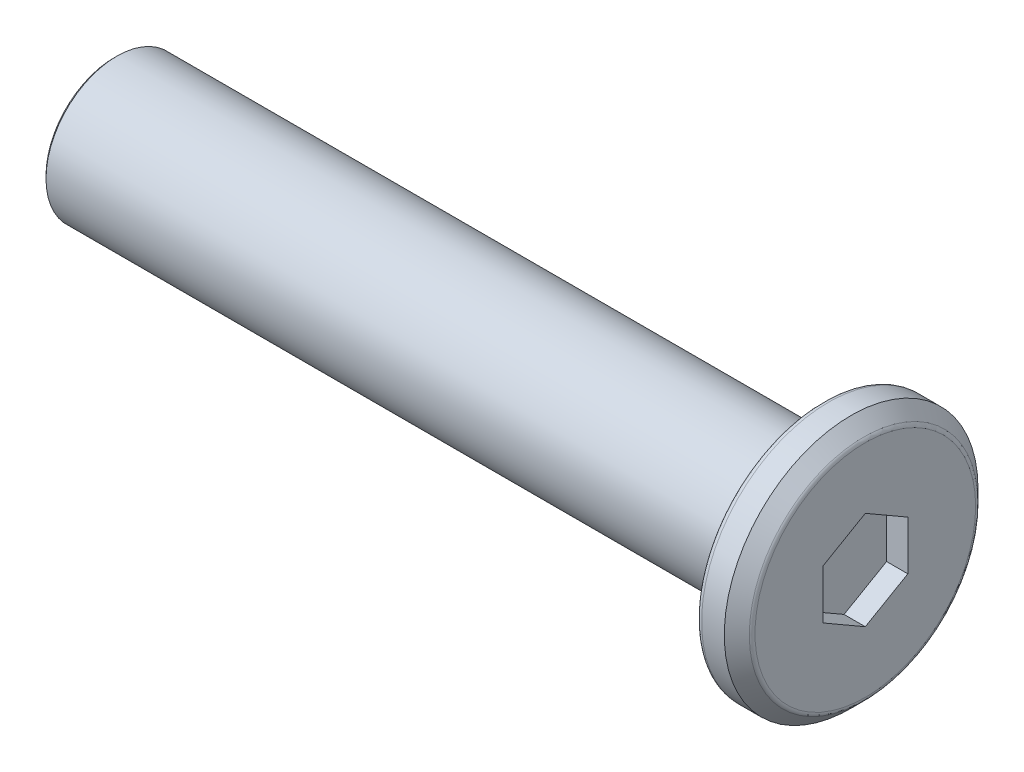
ISO-10303-21;
HEADER;
FILE_DESCRIPTION(('STEP AP214'),'2;1');
FILE_NAME('part.step','',(''),(''),'','','');
FILE_SCHEMA(('AUTOMOTIVE_DESIGN { 1 0 10303 214 1 1 1 1 }'));
ENDSEC;
DATA;
#1=APPLICATION_CONTEXT('core data for automotive mechanical design processes');
#2=APPLICATION_PROTOCOL_DEFINITION('international standard','automotive_design',2000,#1);
#3=PRODUCT_CONTEXT('',#1,'mechanical');
#4=PRODUCT('Part','Part','',(#3));
#5=PRODUCT_RELATED_PRODUCT_CATEGORY('part','',(#4));
#6=PRODUCT_DEFINITION_FORMATION('','',#4);
#7=PRODUCT_DEFINITION_CONTEXT('part definition',#1,'design');
#8=PRODUCT_DEFINITION('design','',#6,#7);
#9=PRODUCT_DEFINITION_SHAPE('','',#8);
#10=(LENGTH_UNIT() NAMED_UNIT(*) SI_UNIT(.MILLI.,.METRE.));
#11=(NAMED_UNIT(*) PLANE_ANGLE_UNIT() SI_UNIT($,.RADIAN.));
#12=(NAMED_UNIT(*) SI_UNIT($,.STERADIAN.) SOLID_ANGLE_UNIT());
#13=UNCERTAINTY_MEASURE_WITH_UNIT(LENGTH_MEASURE(1.E-05),#10,'distance_accuracy_value','');
#14=(GEOMETRIC_REPRESENTATION_CONTEXT(3) GLOBAL_UNCERTAINTY_ASSIGNED_CONTEXT((#13)) GLOBAL_UNIT_ASSIGNED_CONTEXT((#10,
#11,#12)) REPRESENTATION_CONTEXT('',''));
#15=CARTESIAN_POINT('',(0.,0.,0.));
#16=DIRECTION('',(0.,0.,1.));
#17=DIRECTION('',(1.,0.,0.));
#18=AXIS2_PLACEMENT_3D('',#15,#16,#17);
#19=CARTESIAN_POINT('',(0.75,0.,0.));
#20=DIRECTION('',(1.,0.,0.));
#21=DIRECTION('',(0.,0.,-1.));
#22=AXIS2_PLACEMENT_3D('',#19,#20,#21);
#23=PLANE('',#22);
#24=CARTESIAN_POINT('',(0.75,0.,0.));
#25=DIRECTION('',(1.,0.,0.));
#26=DIRECTION('',(0.,0.,-1.));
#27=AXIS2_PLACEMENT_3D('',#24,#25,#26);
#28=CIRCLE('',#27,3.89215728752539);
#29=CARTESIAN_POINT('',(0.75,0.,-3.89215728752539));
#30=VERTEX_POINT('',#29);
#31=EDGE_CURVE('E132',#30,#30,#28,.T.);
#32=ORIENTED_EDGE('',*,*,#31,.T.);
#33=EDGE_LOOP('',(#32));
#34=FACE_BOUND('',#33,.T.);
#35=DIRECTION('',(0.,-1.,0.));
#36=VECTOR('',#35,1.);
#37=CARTESIAN_POINT('',(0.75,0.,-1.5));
#38=LINE('',#37,#36);
#39=CARTESIAN_POINT('',(0.75,0.866025403784438,-1.5));
#40=VERTEX_POINT('',#39);
#41=CARTESIAN_POINT('',(0.75,-0.866025403784439,-1.5));
#42=VERTEX_POINT('',#41);
#43=EDGE_CURVE('E120',#40,#42,#38,.T.);
#44=ORIENTED_EDGE('',*,*,#43,.T.);
#45=DIRECTION('',(0.,-0.5,0.866025403784439));
#46=VECTOR('',#45,1.);
#47=CARTESIAN_POINT('',(0.75,-1.29903810567666,-0.75));
#48=LINE('',#47,#46);
#49=CARTESIAN_POINT('',(0.75,-1.73205080756888,0.));
#50=VERTEX_POINT('',#49);
#51=EDGE_CURVE('E40',#42,#50,#48,.T.);
#52=ORIENTED_EDGE('',*,*,#51,.T.);
#53=DIRECTION('',(0.,0.5,0.866025403784439));
#54=VECTOR('',#53,1.);
#55=CARTESIAN_POINT('',(0.75,-1.29903810567666,0.75));
#56=LINE('',#55,#54);
#57=CARTESIAN_POINT('',(0.75,-0.866025403784438,1.5));
#58=VERTEX_POINT('',#57);
#59=EDGE_CURVE('E76',#50,#58,#56,.T.);
#60=ORIENTED_EDGE('',*,*,#59,.T.);
#61=DIRECTION('',(0.,1.,0.));
#62=VECTOR('',#61,1.);
#63=CARTESIAN_POINT('',(0.75,0.,1.5));
#64=LINE('',#63,#62);
#65=CARTESIAN_POINT('',(0.75,0.866025403784439,1.5));
#66=VERTEX_POINT('',#65);
#67=EDGE_CURVE('E111',#58,#66,#64,.T.);
#68=ORIENTED_EDGE('',*,*,#67,.T.);
#69=DIRECTION('',(0.,0.5,-0.866025403784439));
#70=VECTOR('',#69,1.);
#71=CARTESIAN_POINT('',(0.75,1.29903810567666,0.75));
#72=LINE('',#71,#70);
#73=CARTESIAN_POINT('',(0.75,1.73205080756888,0.));
#74=VERTEX_POINT('',#73);
#75=EDGE_CURVE('E114',#66,#74,#72,.T.);
#76=ORIENTED_EDGE('',*,*,#75,.T.);
#77=DIRECTION('',(0.,-0.5,-0.866025403784439));
#78=VECTOR('',#77,1.);
#79=CARTESIAN_POINT('',(0.75,1.29903810567666,-0.75));
#80=LINE('',#79,#78);
#81=EDGE_CURVE('E117',#74,#40,#80,.T.);
#82=ORIENTED_EDGE('',*,*,#81,.T.);
#83=EDGE_LOOP('',(#44,#52,#60,#68,#76,#82));
#84=FACE_BOUND('',#83,.T.);
#85=ADVANCED_FACE('F16',(#34,#84),#23,.T.);
#86=CARTESIAN_POINT('',(-0.75,0.,0.));
#87=DIRECTION('',(1.,0.,0.));
#88=DIRECTION('',(0.,0.,-1.));
#89=AXIS2_PLACEMENT_3D('',#86,#87,#88);
#90=PLANE('',#89);
#91=CARTESIAN_POINT('',(-0.75,0.,0.));
#92=DIRECTION('',(1.,0.,0.));
#93=DIRECTION('',(0.,0.,-1.));
#94=AXIS2_PLACEMENT_3D('',#91,#92,#93);
#95=CIRCLE('',#94,4.275);
#96=CARTESIAN_POINT('',(-0.75,0.,-4.275));
#97=VERTEX_POINT('',#96);
#98=EDGE_CURVE('E141',#97,#97,#95,.F.);
#99=ORIENTED_EDGE('',*,*,#98,.T.);
#100=EDGE_LOOP('',(#99));
#101=FACE_BOUND('',#100,.T.);
#102=CARTESIAN_POINT('',(-0.75,0.,0.));
#103=DIRECTION('',(1.,0.,0.));
#104=DIRECTION('',(0.,0.,-1.));
#105=AXIS2_PLACEMENT_3D('',#102,#103,#104);
#106=CIRCLE('',#105,2.75);
#107=CARTESIAN_POINT('',(-0.75,0.,-2.75));
#108=VERTEX_POINT('',#107);
#109=EDGE_CURVE('E129',#108,#108,#106,.T.);
#110=ORIENTED_EDGE('',*,*,#109,.T.);
#111=EDGE_LOOP('',(#110));
#112=FACE_BOUND('',#111,.T.);
#113=ADVANCED_FACE('F159',(#101,#112),#90,.F.);
#114=CARTESIAN_POINT('',(0.75,0.,0.));
#115=DIRECTION('',(-1.,0.,0.));
#116=DIRECTION('',(0.,0.,1.));
#117=AXIS2_PLACEMENT_3D('',#114,#115,#116);
#118=CYLINDRICAL_SURFACE('',#117,4.475);
#119=CARTESIAN_POINT('',(-0.55,0.,0.));
#120=DIRECTION('',(1.,0.,0.));
#121=DIRECTION('',(0.,0.,-1.));
#122=AXIS2_PLACEMENT_3D('',#119,#120,#121);
#123=CIRCLE('',#122,4.475);
#124=CARTESIAN_POINT('',(-0.55,0.,-4.475));
#125=VERTEX_POINT('',#124);
#126=EDGE_CURVE('E138',#125,#125,#123,.T.);
#127=ORIENTED_EDGE('',*,*,#126,.T.);
#128=EDGE_LOOP('',(#127));
#129=FACE_BOUND('',#128,.T.);
#130=CARTESIAN_POINT('',(0.250000000000007,0.,0.));
#131=DIRECTION('',(1.,0.,0.));
#132=DIRECTION('',(0.,0.,-1.));
#133=AXIS2_PLACEMENT_3D('',#130,#131,#132);
#134=CIRCLE('',#133,4.475);
#135=CARTESIAN_POINT('',(0.250000000000007,0.,-4.475));
#136=VERTEX_POINT('',#135);
#137=EDGE_CURVE('E123',#136,#136,#134,.F.);
#138=ORIENTED_EDGE('',*,*,#137,.T.);
#139=EDGE_LOOP('',(#138));
#140=FACE_BOUND('',#139,.T.);
#141=ADVANCED_FACE('F165',(#129,#140),#118,.T.);
#142=CARTESIAN_POINT('',(-25.75,0.,0.));
#143=DIRECTION('',(1.,0.,0.));
#144=DIRECTION('',(0.,0.,-1.));
#145=AXIS2_PLACEMENT_3D('',#142,#143,#144);
#146=CYLINDRICAL_SURFACE('',#145,2.5);
#147=CARTESIAN_POINT('',(-25.65,0.,0.));
#148=DIRECTION('',(-1.,0.,0.));
#149=DIRECTION('',(0.,0.,1.));
#150=AXIS2_PLACEMENT_3D('',#147,#148,#149);
#151=CIRCLE('',#150,2.5);
#152=CARTESIAN_POINT('',(-25.65,0.,2.5));
#153=VERTEX_POINT('',#152);
#154=EDGE_CURVE('E10',#153,#153,#151,.F.);
#155=ORIENTED_EDGE('',*,*,#154,.T.);
#156=EDGE_LOOP('',(#155));
#157=FACE_BOUND('',#156,.T.);
#158=CARTESIAN_POINT('',(-1.,0.,0.));
#159=DIRECTION('',(1.,0.,0.));
#160=DIRECTION('',(0.,0.,-1.));
#161=AXIS2_PLACEMENT_3D('',#158,#159,#160);
#162=CIRCLE('',#161,2.5);
#163=CARTESIAN_POINT('',(-1.,0.,-2.5));
#164=VERTEX_POINT('',#163);
#165=EDGE_CURVE('E126',#164,#164,#162,.F.);
#166=ORIENTED_EDGE('',*,*,#165,.T.);
#167=EDGE_LOOP('',(#166));
#168=FACE_BOUND('',#167,.T.);
#169=ADVANCED_FACE('F170',(#157,#168),#146,.T.);
#170=CARTESIAN_POINT('',(-25.75,0.,0.));
#171=DIRECTION('',(-1.,0.,0.));
#172=DIRECTION('',(0.,0.,1.));
#173=AXIS2_PLACEMENT_3D('',#170,#171,#172);
#174=PLANE('',#173);
#175=CARTESIAN_POINT('',(-25.75,0.,0.));
#176=DIRECTION('',(-1.,0.,0.));
#177=DIRECTION('',(0.,0.,1.));
#178=AXIS2_PLACEMENT_3D('',#175,#176,#177);
#179=CIRCLE('',#178,2.4);
#180=CARTESIAN_POINT('',(-25.75,0.,2.4));
#181=VERTEX_POINT('',#180);
#182=EDGE_CURVE('E25',#181,#181,#179,.T.);
#183=ORIENTED_EDGE('',*,*,#182,.T.);
#184=EDGE_LOOP('',(#183));
#185=FACE_BOUND('',#184,.T.);
#186=ADVANCED_FACE('F146',(#185),#174,.T.);
#187=CARTESIAN_POINT('',(2.,-1.73205080756888,0.));
#188=DIRECTION('',(0.,0.866025403784439,0.5));
#189=DIRECTION('',(0.,-0.5,0.866025403784439));
#190=AXIS2_PLACEMENT_3D('',#187,#188,#189);
#191=PLANE('',#190);
#192=DIRECTION('',(-1.,0.,0.));
#193=VECTOR('',#192,1.);
#194=CARTESIAN_POINT('',(2.,-0.866025403784439,-1.5));
#195=LINE('',#194,#193);
#196=CARTESIAN_POINT('',(0.,-0.866025403784439,-1.5));
#197=VERTEX_POINT('',#196);
#198=EDGE_CURVE('E69',#42,#197,#195,.T.);
#199=ORIENTED_EDGE('',*,*,#198,.T.);
#200=DIRECTION('',(0.,0.5,-0.866025403784439));
#201=VECTOR('',#200,1.);
#202=CARTESIAN_POINT('',(0.,-1.73205080756888,0.));
#203=LINE('',#202,#201);
#204=CARTESIAN_POINT('',(0.,-1.73205080756888,0.));
#205=VERTEX_POINT('',#204);
#206=EDGE_CURVE('E73',#205,#197,#203,.T.);
#207=ORIENTED_EDGE('',*,*,#206,.F.);
#208=DIRECTION('',(-1.,0.,0.));
#209=VECTOR('',#208,1.);
#210=CARTESIAN_POINT('',(2.,-1.73205080756888,0.));
#211=LINE('',#210,#209);
#212=EDGE_CURVE('E101',#50,#205,#211,.T.);
#213=ORIENTED_EDGE('',*,*,#212,.F.);
#214=ORIENTED_EDGE('',*,*,#51,.F.);
#215=EDGE_LOOP('',(#199,#207,#213,#214));
#216=FACE_BOUND('',#215,.T.);
#217=ADVANCED_FACE('F71',(#216),#191,.T.);
#218=CARTESIAN_POINT('',(2.,-0.866025403784439,-1.5));
#219=DIRECTION('',(0.,0.,1.));
#220=DIRECTION('',(1.,0.,0.));
#221=AXIS2_PLACEMENT_3D('',#218,#219,#220);
#222=PLANE('',#221);
#223=DIRECTION('',(-1.,0.,0.));
#224=VECTOR('',#223,1.);
#225=CARTESIAN_POINT('',(2.,0.866025403784438,-1.5));
#226=LINE('',#225,#224);
#227=CARTESIAN_POINT('',(0.,0.866025403784438,-1.5));
#228=VERTEX_POINT('',#227);
#229=EDGE_CURVE('E77',#40,#228,#226,.T.);
#230=ORIENTED_EDGE('',*,*,#229,.T.);
#231=DIRECTION('',(0.,1.,0.));
#232=VECTOR('',#231,1.);
#233=CARTESIAN_POINT('',(0.,-0.866025403784439,-1.5));
#234=LINE('',#233,#232);
#235=EDGE_CURVE('E80',#197,#228,#234,.T.);
#236=ORIENTED_EDGE('',*,*,#235,.F.);
#237=ORIENTED_EDGE('',*,*,#198,.F.);
#238=ORIENTED_EDGE('',*,*,#43,.F.);
#239=EDGE_LOOP('',(#230,#236,#237,#238));
#240=FACE_BOUND('',#239,.T.);
#241=ADVANCED_FACE('F81',(#240),#222,.T.);
#242=CARTESIAN_POINT('',(2.,0.866025403784438,-1.5));
#243=DIRECTION('',(0.,-0.866025403784439,0.5));
#244=DIRECTION('',(0.,-0.5,-0.866025403784439));
#245=AXIS2_PLACEMENT_3D('',#242,#243,#244);
#246=PLANE('',#245);
#247=DIRECTION('',(-1.,0.,0.));
#248=VECTOR('',#247,1.);
#249=CARTESIAN_POINT('',(2.,1.73205080756888,0.));
#250=LINE('',#249,#248);
#251=CARTESIAN_POINT('',(0.,1.73205080756888,0.));
#252=VERTEX_POINT('',#251);
#253=EDGE_CURVE('E106',#74,#252,#250,.T.);
#254=ORIENTED_EDGE('',*,*,#253,.T.);
#255=DIRECTION('',(0.,0.5,0.866025403784438));
#256=VECTOR('',#255,1.);
#257=CARTESIAN_POINT('',(0.,0.866025403784438,-1.5));
#258=LINE('',#257,#256);
#259=EDGE_CURVE('E86',#228,#252,#258,.T.);
#260=ORIENTED_EDGE('',*,*,#259,.F.);
#261=ORIENTED_EDGE('',*,*,#229,.F.);
#262=ORIENTED_EDGE('',*,*,#81,.F.);
#263=EDGE_LOOP('',(#254,#260,#261,#262));
#264=FACE_BOUND('',#263,.T.);
#265=ADVANCED_FACE('F288',(#264),#246,.T.);
#266=CARTESIAN_POINT('',(2.,1.73205080756888,0.));
#267=DIRECTION('',(0.,-0.866025403784439,-0.5));
#268=DIRECTION('',(0.,0.5,-0.866025403784439));
#269=AXIS2_PLACEMENT_3D('',#266,#267,#268);
#270=PLANE('',#269);
#271=DIRECTION('',(-1.,0.,0.));
#272=VECTOR('',#271,1.);
#273=CARTESIAN_POINT('',(2.,0.866025403784439,1.5));
#274=LINE('',#273,#272);
#275=CARTESIAN_POINT('',(0.,0.866025403784439,1.5));
#276=VERTEX_POINT('',#275);
#277=EDGE_CURVE('E104',#66,#276,#274,.T.);
#278=ORIENTED_EDGE('',*,*,#277,.T.);
#279=DIRECTION('',(0.,-0.5,0.866025403784439));
#280=VECTOR('',#279,1.);
#281=CARTESIAN_POINT('',(0.,1.73205080756888,0.));
#282=LINE('',#281,#280);
#283=EDGE_CURVE('E95',#252,#276,#282,.T.);
#284=ORIENTED_EDGE('',*,*,#283,.F.);
#285=ORIENTED_EDGE('',*,*,#253,.F.);
#286=ORIENTED_EDGE('',*,*,#75,.F.);
#287=EDGE_LOOP('',(#278,#284,#285,#286));
#288=FACE_BOUND('',#287,.T.);
#289=ADVANCED_FACE('F279',(#288),#270,.T.);
#290=CARTESIAN_POINT('',(2.,0.866025403784439,1.5));
#291=DIRECTION('',(0.,0.,-1.));
#292=DIRECTION('',(-1.,0.,0.));
#293=AXIS2_PLACEMENT_3D('',#290,#291,#292);
#294=PLANE('',#293);
#295=DIRECTION('',(-1.,0.,0.));
#296=VECTOR('',#295,1.);
#297=CARTESIAN_POINT('',(2.,-0.866025403784438,1.5));
#298=LINE('',#297,#296);
#299=CARTESIAN_POINT('',(0.,-0.866025403784438,1.5));
#300=VERTEX_POINT('',#299);
#301=EDGE_CURVE('E32',#58,#300,#298,.T.);
#302=ORIENTED_EDGE('',*,*,#301,.T.);
#303=DIRECTION('',(0.,-1.,0.));
#304=VECTOR('',#303,1.);
#305=CARTESIAN_POINT('',(0.,0.866025403784439,1.5));
#306=LINE('',#305,#304);
#307=EDGE_CURVE('E98',#276,#300,#306,.T.);
#308=ORIENTED_EDGE('',*,*,#307,.F.);
#309=ORIENTED_EDGE('',*,*,#277,.F.);
#310=ORIENTED_EDGE('',*,*,#67,.F.);
#311=EDGE_LOOP('',(#302,#308,#309,#310));
#312=FACE_BOUND('',#311,.T.);
#313=ADVANCED_FACE('F271',(#312),#294,.T.);
#314=CARTESIAN_POINT('',(2.,-0.866025403784438,1.5));
#315=DIRECTION('',(0.,0.866025403784438,-0.5));
#316=DIRECTION('',(0.,0.5,0.866025403784439));
#317=AXIS2_PLACEMENT_3D('',#314,#315,#316);
#318=PLANE('',#317);
#319=ORIENTED_EDGE('',*,*,#212,.T.);
#320=DIRECTION('',(0.,-0.5,-0.866025403784438));
#321=VECTOR('',#320,1.);
#322=CARTESIAN_POINT('',(0.,-0.866025403784438,1.5));
#323=LINE('',#322,#321);
#324=EDGE_CURVE('E91',#300,#205,#323,.T.);
#325=ORIENTED_EDGE('',*,*,#324,.F.);
#326=ORIENTED_EDGE('',*,*,#301,.F.);
#327=ORIENTED_EDGE('',*,*,#59,.F.);
#328=EDGE_LOOP('',(#319,#325,#326,#327));
#329=FACE_BOUND('',#328,.T.);
#330=ADVANCED_FACE('F263',(#329),#318,.T.);
#331=CARTESIAN_POINT('',(0.,0.,0.));
#332=DIRECTION('',(1.,0.,0.));
#333=DIRECTION('',(0.,0.,-1.));
#334=AXIS2_PLACEMENT_3D('',#331,#332,#333);
#335=PLANE('',#334);
#336=ORIENTED_EDGE('',*,*,#206,.T.);
#337=ORIENTED_EDGE('',*,*,#235,.T.);
#338=ORIENTED_EDGE('',*,*,#259,.T.);
#339=ORIENTED_EDGE('',*,*,#283,.T.);
#340=ORIENTED_EDGE('',*,*,#307,.T.);
#341=ORIENTED_EDGE('',*,*,#324,.T.);
#342=EDGE_LOOP('',(#336,#337,#338,#339,#340,#341));
#343=FACE_BOUND('',#342,.T.);
#344=ADVANCED_FACE('F89',(#343),#335,.T.);
#345=CARTESIAN_POINT('',(0.75,0.,0.));
#346=DIRECTION('',(-1.,0.,0.));
#347=DIRECTION('',(0.,0.,1.));
#348=AXIS2_PLACEMENT_3D('',#345,#346,#347);
#349=CONICAL_SURFACE('',#348,3.97500000000001,0.785398163397449);
#350=CARTESIAN_POINT('',(0.691421356237309,0.,0.));
#351=DIRECTION('',(1.,0.,0.));
#352=DIRECTION('',(0.,0.,-1.));
#353=AXIS2_PLACEMENT_3D('',#350,#351,#352);
#354=CIRCLE('',#353,4.0335786437627);
#355=CARTESIAN_POINT('',(0.691421356237309,0.,-4.0335786437627));
#356=VERTEX_POINT('',#355);
#357=EDGE_CURVE('E135',#356,#356,#354,.F.);
#358=ORIENTED_EDGE('',*,*,#357,.T.);
#359=EDGE_LOOP('',(#358));
#360=FACE_BOUND('',#359,.T.);
#361=ORIENTED_EDGE('',*,*,#137,.F.);
#362=EDGE_LOOP('',(#361));
#363=FACE_BOUND('',#362,.T.);
#364=ADVANCED_FACE('F176',(#360,#363),#349,.T.);
#365=CARTESIAN_POINT('',(-1.,0.,0.));
#366=DIRECTION('',(1.,0.,0.));
#367=DIRECTION('',(0.,0.,-1.));
#368=AXIS2_PLACEMENT_3D('',#365,#366,#367);
#369=TOROIDAL_SURFACE('',#368,2.75,0.25);
#370=ORIENTED_EDGE('',*,*,#109,.F.);
#371=EDGE_LOOP('',(#370));
#372=FACE_BOUND('',#371,.T.);
#373=ORIENTED_EDGE('',*,*,#165,.F.);
#374=EDGE_LOOP('',(#373));
#375=FACE_BOUND('',#374,.T.);
#376=ADVANCED_FACE('F179',(#372,#375),#369,.F.);
#377=CARTESIAN_POINT('',(0.55,0.,0.));
#378=DIRECTION('',(1.,0.,0.));
#379=DIRECTION('',(0.,0.,-1.));
#380=AXIS2_PLACEMENT_3D('',#377,#378,#379);
#381=TOROIDAL_SURFACE('',#380,3.89215728752539,0.2);
#382=ORIENTED_EDGE('',*,*,#357,.F.);
#383=EDGE_LOOP('',(#382));
#384=FACE_BOUND('',#383,.T.);
#385=ORIENTED_EDGE('',*,*,#31,.F.);
#386=EDGE_LOOP('',(#385));
#387=FACE_BOUND('',#386,.T.);
#388=ADVANCED_FACE('F155',(#384,#387),#381,.T.);
#389=CARTESIAN_POINT('',(-0.55,0.,0.));
#390=DIRECTION('',(1.,0.,0.));
#391=DIRECTION('',(0.,0.,-1.));
#392=AXIS2_PLACEMENT_3D('',#389,#390,#391);
#393=TOROIDAL_SURFACE('',#392,4.275,0.2);
#394=ORIENTED_EDGE('',*,*,#98,.F.);
#395=EDGE_LOOP('',(#394));
#396=FACE_BOUND('',#395,.T.);
#397=ORIENTED_EDGE('',*,*,#126,.F.);
#398=EDGE_LOOP('',(#397));
#399=FACE_BOUND('',#398,.T.);
#400=ADVANCED_FACE('F149',(#396,#399),#393,.T.);
#401=CARTESIAN_POINT('',(-25.75,0.,0.));
#402=DIRECTION('',(1.,0.,0.));
#403=DIRECTION('',(0.,0.,-1.));
#404=AXIS2_PLACEMENT_3D('',#401,#402,#403);
#405=CONICAL_SURFACE('',#404,2.4,0.785398163397455);
#406=ORIENTED_EDGE('',*,*,#154,.F.);
#407=EDGE_LOOP('',(#406));
#408=FACE_BOUND('',#407,.T.);
#409=ORIENTED_EDGE('',*,*,#182,.F.);
#410=EDGE_LOOP('',(#409));
#411=FACE_BOUND('',#410,.T.);
#412=ADVANCED_FACE('F19',(#408,#411),#405,.T.);
#413=CLOSED_SHELL('',(#85,#113,#141,#169,#186,#217,#241,#265,#289,#313,#330,#344,#364,#376,#388,
#400,#412));
#414=MANIFOLD_SOLID_BREP('B1',#413);
#415=ADVANCED_BREP_SHAPE_REPRESENTATION('',(#18,#414),#14);
#416=SHAPE_DEFINITION_REPRESENTATION(#9,#415);
ENDSEC;
END-ISO-10303-21;
